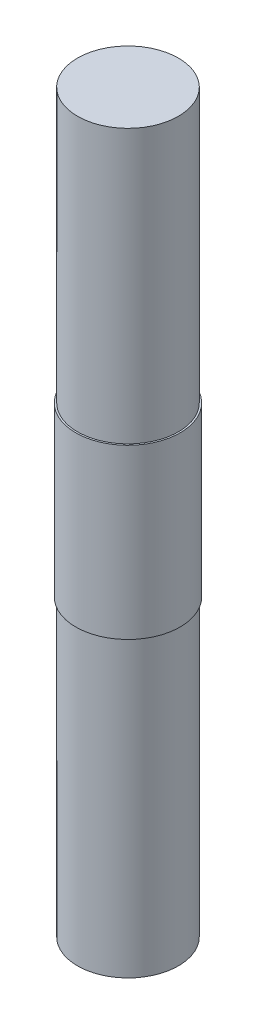
ISO-10303-21;
HEADER;
FILE_DESCRIPTION(('STEP AP214'),'2;1');
FILE_NAME('part.step','',(''),(''),'','','');
FILE_SCHEMA(('AUTOMOTIVE_DESIGN { 1 0 10303 214 1 1 1 1 }'));
ENDSEC;
DATA;
#1=APPLICATION_CONTEXT('core data for automotive mechanical design processes');
#2=APPLICATION_PROTOCOL_DEFINITION('international standard','automotive_design',2000,#1);
#3=PRODUCT_CONTEXT('',#1,'mechanical');
#4=PRODUCT('Part','Part','',(#3));
#5=PRODUCT_RELATED_PRODUCT_CATEGORY('part','',(#4));
#6=PRODUCT_DEFINITION_FORMATION('','',#4);
#7=PRODUCT_DEFINITION_CONTEXT('part definition',#1,'design');
#8=PRODUCT_DEFINITION('design','',#6,#7);
#9=PRODUCT_DEFINITION_SHAPE('','',#8);
#10=(LENGTH_UNIT() NAMED_UNIT(*) SI_UNIT(.MILLI.,.METRE.));
#11=(NAMED_UNIT(*) PLANE_ANGLE_UNIT() SI_UNIT($,.RADIAN.));
#12=(NAMED_UNIT(*) SI_UNIT($,.STERADIAN.) SOLID_ANGLE_UNIT());
#13=UNCERTAINTY_MEASURE_WITH_UNIT(LENGTH_MEASURE(1.E-05),#10,'distance_accuracy_value','');
#14=(GEOMETRIC_REPRESENTATION_CONTEXT(3) GLOBAL_UNCERTAINTY_ASSIGNED_CONTEXT((#13)) GLOBAL_UNIT_ASSIGNED_CONTEXT((#10,
#11,#12)) REPRESENTATION_CONTEXT('',''));
#15=CARTESIAN_POINT('',(0.,0.,0.));
#16=DIRECTION('',(0.,0.,1.));
#17=DIRECTION('',(1.,0.,0.));
#18=AXIS2_PLACEMENT_3D('',#15,#16,#17);
#19=CARTESIAN_POINT('',(0.,0.,0.));
#20=DIRECTION('',(0.,-1.,0.));
#21=DIRECTION('',(1.,0.,0.));
#22=AXIS2_PLACEMENT_3D('',#19,#20,#21);
#23=PLANE('',#22);
#24=CARTESIAN_POINT('',(0.,0.,0.));
#25=DIRECTION('',(0.,1.,0.));
#26=DIRECTION('',(-1.,0.,0.));
#27=AXIS2_PLACEMENT_3D('',#24,#25,#26);
#28=CIRCLE('',#27,6.);
#29=CARTESIAN_POINT('',(-6.,0.,0.));
#30=VERTEX_POINT('',#29);
#31=EDGE_CURVE('E10',#30,#30,#28,.T.);
#32=ORIENTED_EDGE('',*,*,#31,.T.);
#33=EDGE_LOOP('',(#32));
#34=FACE_BOUND('',#33,.T.);
#35=ADVANCED_FACE('F31',(#34),#23,.F.);
#36=CARTESIAN_POINT('',(0.,0.,0.));
#37=DIRECTION('',(0.,1.,0.));
#38=DIRECTION('',(-1.,0.,0.));
#39=AXIS2_PLACEMENT_3D('',#36,#37,#38);
#40=CYLINDRICAL_SURFACE('',#39,6.);
#41=ORIENTED_EDGE('',*,*,#31,.F.);
#42=EDGE_LOOP('',(#41));
#43=FACE_BOUND('',#42,.T.);
#44=CARTESIAN_POINT('',(0.,-32.5,0.));
#45=DIRECTION('',(0.,1.,0.));
#46=DIRECTION('',(-1.,0.,0.));
#47=AXIS2_PLACEMENT_3D('',#44,#45,#46);
#48=CIRCLE('',#47,6.);
#49=CARTESIAN_POINT('',(-6.,-32.5,0.));
#50=VERTEX_POINT('',#49);
#51=EDGE_CURVE('E37',#50,#50,#48,.T.);
#52=ORIENTED_EDGE('',*,*,#51,.T.);
#53=EDGE_LOOP('',(#52));
#54=FACE_BOUND('',#53,.T.);
#55=ADVANCED_FACE('F69',(#43,#54),#40,.T.);
#56=CARTESIAN_POINT('',(6.,-32.5,0.));
#57=DIRECTION('',(0.,-1.,0.));
#58=DIRECTION('',(1.,0.,0.));
#59=AXIS2_PLACEMENT_3D('',#56,#57,#58);
#60=PLANE('',#59);
#61=ORIENTED_EDGE('',*,*,#51,.F.);
#62=EDGE_LOOP('',(#61));
#63=FACE_BOUND('',#62,.T.);
#64=CARTESIAN_POINT('',(0.,-32.5,0.));
#65=DIRECTION('',(0.,1.,0.));
#66=DIRECTION('',(-1.,0.,0.));
#67=AXIS2_PLACEMENT_3D('',#64,#65,#66);
#68=CIRCLE('',#67,6.2);
#69=CARTESIAN_POINT('',(-6.2,-32.5,0.));
#70=VERTEX_POINT('',#69);
#71=EDGE_CURVE('E41',#70,#70,#68,.T.);
#72=ORIENTED_EDGE('',*,*,#71,.T.);
#73=EDGE_LOOP('',(#72));
#74=FACE_BOUND('',#73,.T.);
#75=ADVANCED_FACE('F73',(#63,#74),#60,.F.);
#76=CARTESIAN_POINT('',(0.,0.,0.));
#77=DIRECTION('',(0.,1.,0.));
#78=DIRECTION('',(-1.,0.,0.));
#79=AXIS2_PLACEMENT_3D('',#76,#77,#78);
#80=CYLINDRICAL_SURFACE('',#79,6.2);
#81=ORIENTED_EDGE('',*,*,#71,.F.);
#82=EDGE_LOOP('',(#81));
#83=FACE_BOUND('',#82,.T.);
#84=CARTESIAN_POINT('',(0.,-52.5,0.));
#85=DIRECTION('',(0.,1.,0.));
#86=DIRECTION('',(-1.,0.,0.));
#87=AXIS2_PLACEMENT_3D('',#84,#85,#86);
#88=CIRCLE('',#87,6.2);
#89=CARTESIAN_POINT('',(-6.19999999999999,-52.5,0.));
#90=VERTEX_POINT('',#89);
#91=EDGE_CURVE('E45',#90,#90,#88,.T.);
#92=ORIENTED_EDGE('',*,*,#91,.T.);
#93=EDGE_LOOP('',(#92));
#94=FACE_BOUND('',#93,.T.);
#95=ADVANCED_FACE('F78',(#83,#94),#80,.T.);
#96=CARTESIAN_POINT('',(6.00000000000001,-52.5,0.));
#97=DIRECTION('',(0.,1.,0.));
#98=DIRECTION('',(-1.,0.,0.));
#99=AXIS2_PLACEMENT_3D('',#96,#97,#98);
#100=PLANE('',#99);
#101=ORIENTED_EDGE('',*,*,#91,.F.);
#102=EDGE_LOOP('',(#101));
#103=FACE_BOUND('',#102,.T.);
#104=CARTESIAN_POINT('',(0.,-52.5,0.));
#105=DIRECTION('',(0.,1.,0.));
#106=DIRECTION('',(-1.,0.,0.));
#107=AXIS2_PLACEMENT_3D('',#104,#105,#106);
#108=CIRCLE('',#107,6.);
#109=CARTESIAN_POINT('',(-5.99999999999999,-52.5,0.));
#110=VERTEX_POINT('',#109);
#111=EDGE_CURVE('E50',#110,#110,#108,.T.);
#112=ORIENTED_EDGE('',*,*,#111,.T.);
#113=EDGE_LOOP('',(#112));
#114=FACE_BOUND('',#113,.T.);
#115=ADVANCED_FACE('F65',(#103,#114),#100,.F.);
#116=CARTESIAN_POINT('',(0.,0.,0.));
#117=DIRECTION('',(0.,1.,0.));
#118=DIRECTION('',(-1.,0.,0.));
#119=AXIS2_PLACEMENT_3D('',#116,#117,#118);
#120=CYLINDRICAL_SURFACE('',#119,6.);
#121=ORIENTED_EDGE('',*,*,#111,.F.);
#122=EDGE_LOOP('',(#121));
#123=FACE_BOUND('',#122,.T.);
#124=CARTESIAN_POINT('',(0.,-87.5,0.));
#125=DIRECTION('',(0.,1.,0.));
#126=DIRECTION('',(-1.,0.,0.));
#127=AXIS2_PLACEMENT_3D('',#124,#125,#126);
#128=CIRCLE('',#127,6.);
#129=CARTESIAN_POINT('',(-5.99999999999999,-87.5,0.));
#130=VERTEX_POINT('',#129);
#131=EDGE_CURVE('E53',#130,#130,#128,.T.);
#132=ORIENTED_EDGE('',*,*,#131,.T.);
#133=EDGE_LOOP('',(#132));
#134=FACE_BOUND('',#133,.T.);
#135=ADVANCED_FACE('F57',(#123,#134),#120,.T.);
#136=CARTESIAN_POINT('',(0.,-87.5,0.));
#137=DIRECTION('',(0.,1.,0.));
#138=DIRECTION('',(-1.,0.,0.));
#139=AXIS2_PLACEMENT_3D('',#136,#137,#138);
#140=PLANE('',#139);
#141=ORIENTED_EDGE('',*,*,#131,.F.);
#142=EDGE_LOOP('',(#141));
#143=FACE_BOUND('',#142,.T.);
#144=ADVANCED_FACE('F59',(#143),#140,.F.);
#145=CLOSED_SHELL('',(#35,#55,#75,#95,#115,#135,#144));
#146=MANIFOLD_SOLID_BREP('B2',#145);
#147=ADVANCED_BREP_SHAPE_REPRESENTATION('',(#18,#146),#14);
#148=SHAPE_DEFINITION_REPRESENTATION(#9,#147);
ENDSEC;
END-ISO-10303-21;
